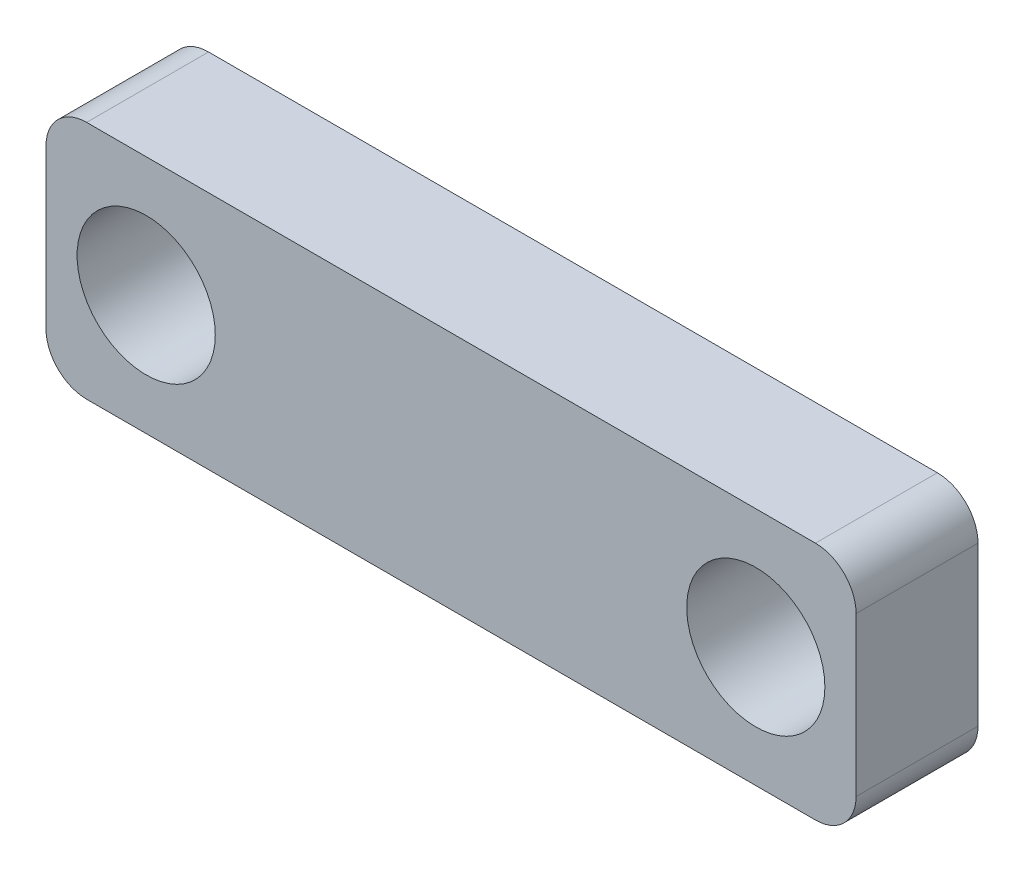
ISO-10303-21;
HEADER;
FILE_DESCRIPTION(('STEP AP214'),'2;1');
FILE_NAME('part.step','',(''),(''),'','','');
FILE_SCHEMA(('AUTOMOTIVE_DESIGN { 1 0 10303 214 1 1 1 1 }'));
ENDSEC;
DATA;
#1=APPLICATION_CONTEXT('core data for automotive mechanical design processes');
#2=APPLICATION_PROTOCOL_DEFINITION('international standard','automotive_design',2000,#1);
#3=PRODUCT_CONTEXT('',#1,'mechanical');
#4=PRODUCT('Part','Part','',(#3));
#5=PRODUCT_RELATED_PRODUCT_CATEGORY('part','',(#4));
#6=PRODUCT_DEFINITION_FORMATION('','',#4);
#7=PRODUCT_DEFINITION_CONTEXT('part definition',#1,'design');
#8=PRODUCT_DEFINITION('design','',#6,#7);
#9=PRODUCT_DEFINITION_SHAPE('','',#8);
#10=(LENGTH_UNIT() NAMED_UNIT(*) SI_UNIT(.MILLI.,.METRE.));
#11=(NAMED_UNIT(*) PLANE_ANGLE_UNIT() SI_UNIT($,.RADIAN.));
#12=(NAMED_UNIT(*) SI_UNIT($,.STERADIAN.) SOLID_ANGLE_UNIT());
#13=UNCERTAINTY_MEASURE_WITH_UNIT(LENGTH_MEASURE(1.E-05),#10,'distance_accuracy_value','');
#14=(GEOMETRIC_REPRESENTATION_CONTEXT(3) GLOBAL_UNCERTAINTY_ASSIGNED_CONTEXT((#13)) GLOBAL_UNIT_ASSIGNED_CONTEXT((#10,
#11,#12)) REPRESENTATION_CONTEXT('',''));
#15=CARTESIAN_POINT('',(0.,0.,0.));
#16=DIRECTION('',(0.,0.,1.));
#17=DIRECTION('',(1.,0.,0.));
#18=AXIS2_PLACEMENT_3D('',#15,#16,#17);
#19=CARTESIAN_POINT('',(-31.2221207225802,40.9398112558445,136.365661293432));
#20=DIRECTION('',(1.,0.,0.));
#21=DIRECTION('',(0.,0.,-1.));
#22=AXIS2_PLACEMENT_3D('',#19,#20,#21);
#23=PLANE('',#22);
#24=DIRECTION('',(0.,-1.,0.));
#25=VECTOR('',#24,1.);
#26=CARTESIAN_POINT('',(-31.2221207225802,40.9398112558445,133.365661293432));
#27=LINE('',#26,#25);
#28=CARTESIAN_POINT('',(-31.2221207225802,39.9398112558445,133.365661293432));
#29=VERTEX_POINT('',#28);
#30=CARTESIAN_POINT('',(-31.2221207225802,36.0398112558445,133.365661293432));
#31=VERTEX_POINT('',#30);
#32=EDGE_CURVE('E128',#29,#31,#27,.T.);
#33=ORIENTED_EDGE('',*,*,#32,.T.);
#34=DIRECTION('',(0.,0.,-1.));
#35=VECTOR('',#34,1.);
#36=CARTESIAN_POINT('',(-31.2221207225802,36.0398112558445,136.365661293432));
#37=LINE('',#36,#35);
#38=CARTESIAN_POINT('',(-31.2221207225802,36.0398112558445,136.365661293432));
#39=VERTEX_POINT('',#38);
#40=EDGE_CURVE('E11',#31,#39,#37,.F.);
#41=ORIENTED_EDGE('',*,*,#40,.T.);
#42=DIRECTION('',(0.,-1.,0.));
#43=VECTOR('',#42,1.);
#44=CARTESIAN_POINT('',(-31.2221207225802,40.9398112558445,136.365661293432));
#45=LINE('',#44,#43);
#46=CARTESIAN_POINT('',(-31.2221207225802,39.9398112558445,136.365661293432));
#47=VERTEX_POINT('',#46);
#48=EDGE_CURVE('E126',#47,#39,#45,.T.);
#49=ORIENTED_EDGE('',*,*,#48,.F.);
#50=DIRECTION('',(0.,0.,-1.));
#51=VECTOR('',#50,1.);
#52=CARTESIAN_POINT('',(-31.2221207225802,39.9398112558445,136.365661293432));
#53=LINE('',#52,#51);
#54=EDGE_CURVE('E40',#47,#29,#53,.T.);
#55=ORIENTED_EDGE('',*,*,#54,.T.);
#56=EDGE_LOOP('',(#33,#41,#49,#55));
#57=FACE_BOUND('',#56,.T.);
#58=ADVANCED_FACE('F32',(#57),#23,.F.);
#59=CARTESIAN_POINT('',(-31.2221207225802,35.0398112558445,136.365661293432));
#60=DIRECTION('',(0.,1.,0.));
#61=DIRECTION('',(0.,0.,1.));
#62=AXIS2_PLACEMENT_3D('',#59,#60,#61);
#63=PLANE('',#62);
#64=DIRECTION('',(1.,0.,0.));
#65=VECTOR('',#64,1.);
#66=CARTESIAN_POINT('',(-31.2221207225802,35.0398112558445,133.365661293432));
#67=LINE('',#66,#65);
#68=CARTESIAN_POINT('',(-30.2221207225802,35.0398112558445,133.365661293432));
#69=VERTEX_POINT('',#68);
#70=CARTESIAN_POINT('',(-12.2894893378649,35.0398112558445,133.365661293432));
#71=VERTEX_POINT('',#70);
#72=EDGE_CURVE('E124',#69,#71,#67,.T.);
#73=ORIENTED_EDGE('',*,*,#72,.T.);
#74=DIRECTION('',(0.,0.,-1.));
#75=VECTOR('',#74,1.);
#76=CARTESIAN_POINT('',(-12.2894893378649,35.0398112558445,136.365661293432));
#77=LINE('',#76,#75);
#78=CARTESIAN_POINT('',(-12.2894893378649,35.0398112558445,136.365661293432));
#79=VERTEX_POINT('',#78);
#80=EDGE_CURVE('E103',#71,#79,#77,.F.);
#81=ORIENTED_EDGE('',*,*,#80,.T.);
#82=DIRECTION('',(1.,0.,0.));
#83=VECTOR('',#82,1.);
#84=CARTESIAN_POINT('',(-31.2221207225802,35.0398112558445,136.365661293432));
#85=LINE('',#84,#83);
#86=CARTESIAN_POINT('',(-30.2221207225802,35.0398112558445,136.365661293432));
#87=VERTEX_POINT('',#86);
#88=EDGE_CURVE('E168',#87,#79,#85,.T.);
#89=ORIENTED_EDGE('',*,*,#88,.F.);
#90=DIRECTION('',(0.,0.,-1.));
#91=VECTOR('',#90,1.);
#92=CARTESIAN_POINT('',(-30.2221207225802,35.0398112558445,136.365661293432));
#93=LINE('',#92,#91);
#94=EDGE_CURVE('E108',#87,#69,#93,.T.);
#95=ORIENTED_EDGE('',*,*,#94,.T.);
#96=EDGE_LOOP('',(#73,#81,#89,#95));
#97=FACE_BOUND('',#96,.T.);
#98=ADVANCED_FACE('F194',(#97),#63,.F.);
#99=CARTESIAN_POINT('',(-11.2894893378649,40.9398112558445,136.365661293432));
#100=DIRECTION('',(-1.,0.,0.));
#101=DIRECTION('',(0.,-1.,0.));
#102=AXIS2_PLACEMENT_3D('',#99,#100,#101);
#103=PLANE('',#102);
#104=DIRECTION('',(0.,1.,0.));
#105=VECTOR('',#104,1.);
#106=CARTESIAN_POINT('',(-11.2894893378649,40.9398112558445,136.365661293432));
#107=LINE('',#106,#105);
#108=CARTESIAN_POINT('',(-11.2894893378649,36.0398112558445,136.365661293432));
#109=VERTEX_POINT('',#108);
#110=CARTESIAN_POINT('',(-11.2894893378649,39.9398112558445,136.365661293432));
#111=VERTEX_POINT('',#110);
#112=EDGE_CURVE('E117',#109,#111,#107,.T.);
#113=ORIENTED_EDGE('',*,*,#112,.F.);
#114=DIRECTION('',(0.,0.,-1.));
#115=VECTOR('',#114,1.);
#116=CARTESIAN_POINT('',(-11.2894893378649,36.0398112558445,136.365661293432));
#117=LINE('',#116,#115);
#118=CARTESIAN_POINT('',(-11.2894893378649,36.0398112558445,133.365661293432));
#119=VERTEX_POINT('',#118);
#120=EDGE_CURVE('E102',#109,#119,#117,.T.);
#121=ORIENTED_EDGE('',*,*,#120,.T.);
#122=DIRECTION('',(0.,1.,0.));
#123=VECTOR('',#122,1.);
#124=CARTESIAN_POINT('',(-11.2894893378649,40.9398112558445,133.365661293432));
#125=LINE('',#124,#123);
#126=CARTESIAN_POINT('',(-11.2894893378649,39.9398112558445,133.365661293432));
#127=VERTEX_POINT('',#126);
#128=EDGE_CURVE('E115',#119,#127,#125,.T.);
#129=ORIENTED_EDGE('',*,*,#128,.T.);
#130=DIRECTION('',(0.,0.,-1.));
#131=VECTOR('',#130,1.);
#132=CARTESIAN_POINT('',(-11.2894893378649,39.9398112558445,136.365661293432));
#133=LINE('',#132,#131);
#134=EDGE_CURVE('E119',#127,#111,#133,.F.);
#135=ORIENTED_EDGE('',*,*,#134,.T.);
#136=EDGE_LOOP('',(#113,#121,#129,#135));
#137=FACE_BOUND('',#136,.T.);
#138=ADVANCED_FACE('F114',(#137),#103,.F.);
#139=CARTESIAN_POINT('',(-31.2221207225802,40.9398112558445,136.365661293432));
#140=DIRECTION('',(0.,-1.,0.));
#141=DIRECTION('',(0.,0.,-1.));
#142=AXIS2_PLACEMENT_3D('',#139,#140,#141);
#143=PLANE('',#142);
#144=DIRECTION('',(-1.,0.,0.));
#145=VECTOR('',#144,1.);
#146=CARTESIAN_POINT('',(-31.2221207225802,40.9398112558445,136.365661293432));
#147=LINE('',#146,#145);
#148=CARTESIAN_POINT('',(-12.2894893378649,40.9398112558445,136.365661293432));
#149=VERTEX_POINT('',#148);
#150=CARTESIAN_POINT('',(-30.2221207225802,40.9398112558445,136.365661293432));
#151=VERTEX_POINT('',#150);
#152=EDGE_CURVE('E132',#149,#151,#147,.T.);
#153=ORIENTED_EDGE('',*,*,#152,.F.);
#154=DIRECTION('',(0.,0.,-1.));
#155=VECTOR('',#154,1.);
#156=CARTESIAN_POINT('',(-12.2894893378649,40.9398112558445,136.365661293432));
#157=LINE('',#156,#155);
#158=CARTESIAN_POINT('',(-12.2894893378649,40.9398112558445,133.365661293432));
#159=VERTEX_POINT('',#158);
#160=EDGE_CURVE('E149',#149,#159,#157,.T.);
#161=ORIENTED_EDGE('',*,*,#160,.T.);
#162=DIRECTION('',(-1.,0.,0.));
#163=VECTOR('',#162,1.);
#164=CARTESIAN_POINT('',(-31.2221207225802,40.9398112558445,133.365661293432));
#165=LINE('',#164,#163);
#166=CARTESIAN_POINT('',(-30.2221207225802,40.9398112558445,133.365661293432));
#167=VERTEX_POINT('',#166);
#168=EDGE_CURVE('E123',#159,#167,#165,.T.);
#169=ORIENTED_EDGE('',*,*,#168,.T.);
#170=DIRECTION('',(0.,0.,-1.));
#171=VECTOR('',#170,1.);
#172=CARTESIAN_POINT('',(-30.2221207225802,40.9398112558445,136.365661293432));
#173=LINE('',#172,#171);
#174=EDGE_CURVE('E47',#167,#151,#173,.F.);
#175=ORIENTED_EDGE('',*,*,#174,.T.);
#176=EDGE_LOOP('',(#153,#161,#169,#175));
#177=FACE_BOUND('',#176,.T.);
#178=ADVANCED_FACE('F187',(#177),#143,.F.);
#179=CARTESIAN_POINT('',(0.,0.,136.365661293432));
#180=DIRECTION('',(0.,0.,1.));
#181=DIRECTION('',(1.,0.,0.));
#182=AXIS2_PLACEMENT_3D('',#179,#180,#181);
#183=PLANE('',#182);
#184=CARTESIAN_POINT('',(-28.7571207225802,37.9898112558445,136.365661293432));
#185=DIRECTION('',(0.,0.,1.));
#186=DIRECTION('',(1.,0.,0.));
#187=AXIS2_PLACEMENT_3D('',#184,#185,#186);
#188=CIRCLE('',#187,1.7);
#189=CARTESIAN_POINT('',(-27.0571207225802,37.9898112558445,136.365661293432));
#190=VERTEX_POINT('',#189);
#191=EDGE_CURVE('E177',#190,#190,#188,.T.);
#192=ORIENTED_EDGE('',*,*,#191,.F.);
#193=EDGE_LOOP('',(#192));
#194=FACE_BOUND('',#193,.T.);
#195=CARTESIAN_POINT('',(-13.7571207225802,37.9898112558445,136.365661293432));
#196=DIRECTION('',(0.,0.,1.));
#197=DIRECTION('',(1.,0.,0.));
#198=AXIS2_PLACEMENT_3D('',#195,#196,#197);
#199=CIRCLE('',#198,1.7);
#200=CARTESIAN_POINT('',(-12.0571207225802,37.9898112558445,136.365661293432));
#201=VERTEX_POINT('',#200);
#202=EDGE_CURVE('E163',#201,#201,#199,.T.);
#203=ORIENTED_EDGE('',*,*,#202,.F.);
#204=EDGE_LOOP('',(#203));
#205=FACE_BOUND('',#204,.T.);
#206=ORIENTED_EDGE('',*,*,#88,.T.);
#207=CARTESIAN_POINT('',(-12.2894893378649,36.0398112558445,136.365661293432));
#208=DIRECTION('',(0.,0.,1.));
#209=DIRECTION('',(1.,0.,0.));
#210=AXIS2_PLACEMENT_3D('',#207,#208,#209);
#211=CIRCLE('',#210,1.);
#212=EDGE_CURVE('E146',#79,#109,#211,.T.);
#213=ORIENTED_EDGE('',*,*,#212,.T.);
#214=ORIENTED_EDGE('',*,*,#112,.T.);
#215=CARTESIAN_POINT('',(-12.2894893378649,39.9398112558445,136.365661293432));
#216=DIRECTION('',(0.,0.,1.));
#217=DIRECTION('',(1.,0.,0.));
#218=AXIS2_PLACEMENT_3D('',#215,#216,#217);
#219=CIRCLE('',#218,1.);
#220=EDGE_CURVE('E54',#111,#149,#219,.T.);
#221=ORIENTED_EDGE('',*,*,#220,.T.);
#222=ORIENTED_EDGE('',*,*,#152,.T.);
#223=CARTESIAN_POINT('',(-30.2221207225802,39.9398112558445,136.365661293432));
#224=DIRECTION('',(0.,0.,1.));
#225=DIRECTION('',(1.,0.,0.));
#226=AXIS2_PLACEMENT_3D('',#223,#224,#225);
#227=CIRCLE('',#226,1.);
#228=EDGE_CURVE('E141',#151,#47,#227,.T.);
#229=ORIENTED_EDGE('',*,*,#228,.T.);
#230=ORIENTED_EDGE('',*,*,#48,.T.);
#231=CARTESIAN_POINT('',(-30.2221207225802,36.0398112558445,136.365661293432));
#232=DIRECTION('',(0.,0.,1.));
#233=DIRECTION('',(1.,0.,0.));
#234=AXIS2_PLACEMENT_3D('',#231,#232,#233);
#235=CIRCLE('',#234,1.);
#236=EDGE_CURVE('E143',#39,#87,#235,.T.);
#237=ORIENTED_EDGE('',*,*,#236,.T.);
#238=EDGE_LOOP('',(#206,#213,#214,#221,#222,#229,#230,#237));
#239=FACE_BOUND('',#238,.T.);
#240=ADVANCED_FACE('F184',(#194,#205,#239),#183,.T.);
#241=CARTESIAN_POINT('',(0.,0.,133.365661293432));
#242=DIRECTION('',(0.,0.,1.));
#243=DIRECTION('',(1.,0.,0.));
#244=AXIS2_PLACEMENT_3D('',#241,#242,#243);
#245=PLANE('',#244);
#246=CARTESIAN_POINT('',(-28.7571207225802,37.9898112558445,133.365661293432));
#247=DIRECTION('',(0.,0.,1.));
#248=DIRECTION('',(1.,0.,0.));
#249=AXIS2_PLACEMENT_3D('',#246,#247,#248);
#250=CIRCLE('',#249,1.7);
#251=CARTESIAN_POINT('',(-27.0571207225802,37.9898112558445,133.365661293432));
#252=VERTEX_POINT('',#251);
#253=EDGE_CURVE('E174',#252,#252,#250,.T.);
#254=ORIENTED_EDGE('',*,*,#253,.T.);
#255=EDGE_LOOP('',(#254));
#256=FACE_BOUND('',#255,.T.);
#257=CARTESIAN_POINT('',(-13.7571207225802,37.9898112558445,133.365661293432));
#258=DIRECTION('',(0.,0.,1.));
#259=DIRECTION('',(1.,0.,0.));
#260=AXIS2_PLACEMENT_3D('',#257,#258,#259);
#261=CIRCLE('',#260,1.7);
#262=CARTESIAN_POINT('',(-12.0571207225802,37.9898112558445,133.365661293432));
#263=VERTEX_POINT('',#262);
#264=EDGE_CURVE('E161',#263,#263,#261,.T.);
#265=ORIENTED_EDGE('',*,*,#264,.T.);
#266=EDGE_LOOP('',(#265));
#267=FACE_BOUND('',#266,.T.);
#268=ORIENTED_EDGE('',*,*,#128,.F.);
#269=CARTESIAN_POINT('',(-12.2894893378649,36.0398112558445,133.365661293432));
#270=DIRECTION('',(0.,0.,1.));
#271=DIRECTION('',(1.,0.,0.));
#272=AXIS2_PLACEMENT_3D('',#269,#270,#271);
#273=CIRCLE('',#272,1.);
#274=EDGE_CURVE('E98',#119,#71,#273,.F.);
#275=ORIENTED_EDGE('',*,*,#274,.T.);
#276=ORIENTED_EDGE('',*,*,#72,.F.);
#277=CARTESIAN_POINT('',(-30.2221207225802,36.0398112558445,133.365661293432));
#278=DIRECTION('',(0.,0.,1.));
#279=DIRECTION('',(1.,0.,0.));
#280=AXIS2_PLACEMENT_3D('',#277,#278,#279);
#281=CIRCLE('',#280,1.);
#282=EDGE_CURVE('E135',#69,#31,#281,.F.);
#283=ORIENTED_EDGE('',*,*,#282,.T.);
#284=ORIENTED_EDGE('',*,*,#32,.F.);
#285=CARTESIAN_POINT('',(-30.2221207225802,39.9398112558445,133.365661293432));
#286=DIRECTION('',(0.,0.,1.));
#287=DIRECTION('',(1.,0.,0.));
#288=AXIS2_PLACEMENT_3D('',#285,#286,#287);
#289=CIRCLE('',#288,1.);
#290=EDGE_CURVE('E118',#29,#167,#289,.F.);
#291=ORIENTED_EDGE('',*,*,#290,.T.);
#292=ORIENTED_EDGE('',*,*,#168,.F.);
#293=CARTESIAN_POINT('',(-12.2894893378649,39.9398112558445,133.365661293432));
#294=DIRECTION('',(0.,0.,1.));
#295=DIRECTION('',(1.,0.,0.));
#296=AXIS2_PLACEMENT_3D('',#293,#294,#295);
#297=CIRCLE('',#296,1.);
#298=EDGE_CURVE('E109',#159,#127,#297,.F.);
#299=ORIENTED_EDGE('',*,*,#298,.T.);
#300=EDGE_LOOP('',(#268,#275,#276,#283,#284,#291,#292,#299));
#301=FACE_BOUND('',#300,.T.);
#302=ADVANCED_FACE('F121',(#256,#267,#301),#245,.F.);
#303=CARTESIAN_POINT('',(-12.2894893378649,36.0398112558445,136.365661293432));
#304=DIRECTION('',(0.,0.,-1.));
#305=DIRECTION('',(-1.,0.,0.));
#306=AXIS2_PLACEMENT_3D('',#303,#304,#305);
#307=CYLINDRICAL_SURFACE('',#306,1.);
#308=ORIENTED_EDGE('',*,*,#212,.F.);
#309=ORIENTED_EDGE('',*,*,#80,.F.);
#310=ORIENTED_EDGE('',*,*,#274,.F.);
#311=ORIENTED_EDGE('',*,*,#120,.F.);
#312=EDGE_LOOP('',(#308,#309,#310,#311));
#313=FACE_BOUND('',#312,.T.);
#314=ADVANCED_FACE('F101',(#313),#307,.T.);
#315=CARTESIAN_POINT('',(-12.2894893378649,39.9398112558445,136.365661293432));
#316=DIRECTION('',(0.,0.,-1.));
#317=DIRECTION('',(-1.,0.,0.));
#318=AXIS2_PLACEMENT_3D('',#315,#316,#317);
#319=CYLINDRICAL_SURFACE('',#318,1.);
#320=ORIENTED_EDGE('',*,*,#220,.F.);
#321=ORIENTED_EDGE('',*,*,#134,.F.);
#322=ORIENTED_EDGE('',*,*,#298,.F.);
#323=ORIENTED_EDGE('',*,*,#160,.F.);
#324=EDGE_LOOP('',(#320,#321,#322,#323));
#325=FACE_BOUND('',#324,.T.);
#326=ADVANCED_FACE('F205',(#325),#319,.T.);
#327=CARTESIAN_POINT('',(-30.2221207225802,36.0398112558445,136.365661293432));
#328=DIRECTION('',(0.,0.,-1.));
#329=DIRECTION('',(-1.,0.,0.));
#330=AXIS2_PLACEMENT_3D('',#327,#328,#329);
#331=CYLINDRICAL_SURFACE('',#330,1.);
#332=ORIENTED_EDGE('',*,*,#236,.F.);
#333=ORIENTED_EDGE('',*,*,#40,.F.);
#334=ORIENTED_EDGE('',*,*,#282,.F.);
#335=ORIENTED_EDGE('',*,*,#94,.F.);
#336=EDGE_LOOP('',(#332,#333,#334,#335));
#337=FACE_BOUND('',#336,.T.);
#338=ADVANCED_FACE('F196',(#337),#331,.T.);
#339=CARTESIAN_POINT('',(-30.2221207225802,39.9398112558445,136.365661293432));
#340=DIRECTION('',(0.,0.,-1.));
#341=DIRECTION('',(-1.,0.,0.));
#342=AXIS2_PLACEMENT_3D('',#339,#340,#341);
#343=CYLINDRICAL_SURFACE('',#342,1.);
#344=ORIENTED_EDGE('',*,*,#228,.F.);
#345=ORIENTED_EDGE('',*,*,#174,.F.);
#346=ORIENTED_EDGE('',*,*,#290,.F.);
#347=ORIENTED_EDGE('',*,*,#54,.F.);
#348=EDGE_LOOP('',(#344,#345,#346,#347));
#349=FACE_BOUND('',#348,.T.);
#350=ADVANCED_FACE('F34',(#349),#343,.T.);
#351=CARTESIAN_POINT('',(-13.7571207225802,37.9898112558445,136.365661293432));
#352=DIRECTION('',(0.,0.,1.));
#353=DIRECTION('',(1.,0.,0.));
#354=AXIS2_PLACEMENT_3D('',#351,#352,#353);
#355=CYLINDRICAL_SURFACE('',#354,1.7);
#356=ORIENTED_EDGE('',*,*,#202,.T.);
#357=EDGE_LOOP('',(#356));
#358=FACE_BOUND('',#357,.T.);
#359=ORIENTED_EDGE('',*,*,#264,.F.);
#360=EDGE_LOOP('',(#359));
#361=FACE_BOUND('',#360,.T.);
#362=ADVANCED_FACE('F198',(#358,#361),#355,.F.);
#363=CARTESIAN_POINT('',(-28.7571207225802,37.9898112558445,136.365661293432));
#364=DIRECTION('',(0.,0.,1.));
#365=DIRECTION('',(1.,0.,0.));
#366=AXIS2_PLACEMENT_3D('',#363,#364,#365);
#367=CYLINDRICAL_SURFACE('',#366,1.7);
#368=ORIENTED_EDGE('',*,*,#191,.T.);
#369=EDGE_LOOP('',(#368));
#370=FACE_BOUND('',#369,.T.);
#371=ORIENTED_EDGE('',*,*,#253,.F.);
#372=EDGE_LOOP('',(#371));
#373=FACE_BOUND('',#372,.T.);
#374=ADVANCED_FACE('F181',(#370,#373),#367,.F.);
#375=CLOSED_SHELL('',(#58,#98,#138,#178,#240,#302,#314,#326,#338,#350,#362,#374));
#376=MANIFOLD_SOLID_BREP('B2',#375);
#377=ADVANCED_BREP_SHAPE_REPRESENTATION('',(#18,#376),#14);
#378=SHAPE_DEFINITION_REPRESENTATION(#9,#377);
ENDSEC;
END-ISO-10303-21;
